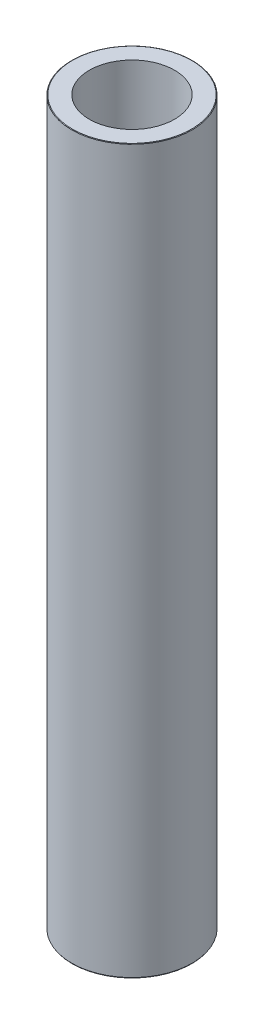
ISO-10303-21;
HEADER;
FILE_DESCRIPTION(('STEP AP214'),'2;1');
FILE_NAME('part.step','',(''),(''),'','','');
FILE_SCHEMA(('AUTOMOTIVE_DESIGN { 1 0 10303 214 1 1 1 1 }'));
ENDSEC;
DATA;
#1=APPLICATION_CONTEXT('core data for automotive mechanical design processes');
#2=APPLICATION_PROTOCOL_DEFINITION('international standard','automotive_design',2000,#1);
#3=PRODUCT_CONTEXT('',#1,'mechanical');
#4=PRODUCT('Part','Part','',(#3));
#5=PRODUCT_RELATED_PRODUCT_CATEGORY('part','',(#4));
#6=PRODUCT_DEFINITION_FORMATION('','',#4);
#7=PRODUCT_DEFINITION_CONTEXT('part definition',#1,'design');
#8=PRODUCT_DEFINITION('design','',#6,#7);
#9=PRODUCT_DEFINITION_SHAPE('','',#8);
#10=(LENGTH_UNIT() NAMED_UNIT(*) SI_UNIT(.MILLI.,.METRE.));
#11=(NAMED_UNIT(*) PLANE_ANGLE_UNIT() SI_UNIT($,.RADIAN.));
#12=(NAMED_UNIT(*) SI_UNIT($,.STERADIAN.) SOLID_ANGLE_UNIT());
#13=UNCERTAINTY_MEASURE_WITH_UNIT(LENGTH_MEASURE(1.E-05),#10,'distance_accuracy_value','');
#14=(GEOMETRIC_REPRESENTATION_CONTEXT(3) GLOBAL_UNCERTAINTY_ASSIGNED_CONTEXT((#13)) GLOBAL_UNIT_ASSIGNED_CONTEXT((#10,
#11,#12)) REPRESENTATION_CONTEXT('',''));
#15=CARTESIAN_POINT('',(0.,0.,0.));
#16=DIRECTION('',(0.,0.,1.));
#17=DIRECTION('',(1.,0.,0.));
#18=AXIS2_PLACEMENT_3D('',#15,#16,#17);
#19=CARTESIAN_POINT('',(0.,600.,0.));
#20=DIRECTION('',(0.,-1.,0.));
#21=DIRECTION('',(0.,0.,-1.));
#22=AXIS2_PLACEMENT_3D('',#19,#20,#21);
#23=CYLINDRICAL_SURFACE('',#22,50.);
#24=CARTESIAN_POINT('',(0.,599.69116420001,0.));
#25=DIRECTION('',(0.,1.,0.));
#26=DIRECTION('',(0.,0.,1.));
#27=AXIS2_PLACEMENT_3D('',#24,#25,#26);
#28=CIRCLE('',#27,50.);
#29=CARTESIAN_POINT('',(0.,599.69116420001,50.));
#30=VERTEX_POINT('',#29);
#31=EDGE_CURVE('E50',#30,#30,#28,.F.);
#32=ORIENTED_EDGE('',*,*,#31,.T.);
#33=EDGE_LOOP('',(#32));
#34=FACE_BOUND('',#33,.T.);
#35=CARTESIAN_POINT('',(0.,0.534919296779512,0.));
#36=DIRECTION('',(0.,1.,0.));
#37=DIRECTION('',(0.,0.,1.));
#38=AXIS2_PLACEMENT_3D('',#35,#36,#37);
#39=CIRCLE('',#38,50.);
#40=CARTESIAN_POINT('',(0.,0.534919296779512,50.));
#41=VERTEX_POINT('',#40);
#42=EDGE_CURVE('E51',#41,#41,#39,.T.);
#43=ORIENTED_EDGE('',*,*,#42,.T.);
#44=EDGE_LOOP('',(#43));
#45=FACE_BOUND('',#44,.T.);
#46=ADVANCED_FACE('F39',(#34,#45),#23,.T.);
#47=CARTESIAN_POINT('',(0.,600.,0.));
#48=DIRECTION('',(0.,1.,0.));
#49=DIRECTION('',(0.,0.,1.));
#50=AXIS2_PLACEMENT_3D('',#47,#48,#49);
#51=PLANE('',#50);
#52=CARTESIAN_POINT('',(0.,600.,0.));
#53=DIRECTION('',(0.,1.,0.));
#54=DIRECTION('',(0.,0.,1.));
#55=AXIS2_PLACEMENT_3D('',#52,#53,#54);
#56=CIRCLE('',#55,49.4650807032204);
#57=CARTESIAN_POINT('',(0.,600.,49.4650807032204));
#58=VERTEX_POINT('',#57);
#59=EDGE_CURVE('E54',#58,#58,#56,.T.);
#60=ORIENTED_EDGE('',*,*,#59,.T.);
#61=EDGE_LOOP('',(#60));
#62=FACE_BOUND('',#61,.T.);
#63=CARTESIAN_POINT('',(0.,600.,0.));
#64=DIRECTION('',(0.,1.,0.));
#65=DIRECTION('',(0.,0.,1.));
#66=AXIS2_PLACEMENT_3D('',#63,#64,#65);
#67=CIRCLE('',#66,35.3533003629534);
#68=CARTESIAN_POINT('',(0.,600.,35.3533003629534));
#69=VERTEX_POINT('',#68);
#70=EDGE_CURVE('E58',#69,#69,#67,.T.);
#71=ORIENTED_EDGE('',*,*,#70,.F.);
#72=EDGE_LOOP('',(#71));
#73=FACE_BOUND('',#72,.T.);
#74=ADVANCED_FACE('F69',(#62,#73),#51,.T.);
#75=CARTESIAN_POINT('',(0.,0.,0.));
#76=DIRECTION('',(0.,1.,0.));
#77=DIRECTION('',(0.,0.,1.));
#78=AXIS2_PLACEMENT_3D('',#75,#76,#77);
#79=PLANE('',#78);
#80=CARTESIAN_POINT('',(0.,0.,0.));
#81=DIRECTION('',(0.,1.,0.));
#82=DIRECTION('',(0.,0.,1.));
#83=AXIS2_PLACEMENT_3D('',#80,#81,#82);
#84=CIRCLE('',#83,49.6911642000096);
#85=CARTESIAN_POINT('',(0.,0.,49.6911642000096));
#86=VERTEX_POINT('',#85);
#87=EDGE_CURVE('E10',#86,#86,#84,.F.);
#88=ORIENTED_EDGE('',*,*,#87,.T.);
#89=EDGE_LOOP('',(#88));
#90=FACE_BOUND('',#89,.T.);
#91=CARTESIAN_POINT('',(0.,0.,0.));
#92=DIRECTION('',(0.,1.,0.));
#93=DIRECTION('',(0.,0.,1.));
#94=AXIS2_PLACEMENT_3D('',#91,#92,#93);
#95=CIRCLE('',#94,35.3533003629534);
#96=CARTESIAN_POINT('',(0.,0.,35.3533003629534));
#97=VERTEX_POINT('',#96);
#98=EDGE_CURVE('E63',#97,#97,#95,.T.);
#99=ORIENTED_EDGE('',*,*,#98,.T.);
#100=EDGE_LOOP('',(#99));
#101=FACE_BOUND('',#100,.T.);
#102=ADVANCED_FACE('F75',(#90,#101),#79,.F.);
#103=CARTESIAN_POINT('',(0.,600.,0.));
#104=DIRECTION('',(0.,-1.,0.));
#105=DIRECTION('',(0.,0.,-1.));
#106=AXIS2_PLACEMENT_3D('',#103,#104,#105);
#107=CYLINDRICAL_SURFACE('',#106,35.3533003629534);
#108=ORIENTED_EDGE('',*,*,#70,.T.);
#109=EDGE_LOOP('',(#108));
#110=FACE_BOUND('',#109,.T.);
#111=ORIENTED_EDGE('',*,*,#98,.F.);
#112=EDGE_LOOP('',(#111));
#113=FACE_BOUND('',#112,.T.);
#114=ADVANCED_FACE('F70',(#110,#113),#107,.F.);
#115=CARTESIAN_POINT('',(0.,600.,0.));
#116=DIRECTION('',(0.,-1.,0.));
#117=DIRECTION('',(0.,0.,-1.));
#118=AXIS2_PLACEMENT_3D('',#115,#116,#117);
#119=CONICAL_SURFACE('',#118,49.4650807032204,1.0471975511966);
#120=ORIENTED_EDGE('',*,*,#31,.F.);
#121=EDGE_LOOP('',(#120));
#122=FACE_BOUND('',#121,.T.);
#123=ORIENTED_EDGE('',*,*,#59,.F.);
#124=EDGE_LOOP('',(#123));
#125=FACE_BOUND('',#124,.T.);
#126=ADVANCED_FACE('F81',(#122,#125),#119,.T.);
#127=CARTESIAN_POINT('',(0.,0.534919296779512,0.));
#128=DIRECTION('',(0.,1.,0.));
#129=DIRECTION('',(0.,0.,1.));
#130=AXIS2_PLACEMENT_3D('',#127,#128,#129);
#131=CONICAL_SURFACE('',#130,50.,0.523598775598293);
#132=ORIENTED_EDGE('',*,*,#87,.F.);
#133=EDGE_LOOP('',(#132));
#134=FACE_BOUND('',#133,.T.);
#135=ORIENTED_EDGE('',*,*,#42,.F.);
#136=EDGE_LOOP('',(#135));
#137=FACE_BOUND('',#136,.T.);
#138=ADVANCED_FACE('F45',(#134,#137),#131,.T.);
#139=CLOSED_SHELL('',(#46,#74,#102,#114,#126,#138));
#140=MANIFOLD_SOLID_BREP('B2',#139);
#141=ADVANCED_BREP_SHAPE_REPRESENTATION('',(#18,#140),#14);
#142=SHAPE_DEFINITION_REPRESENTATION(#9,#141);
ENDSEC;
END-ISO-10303-21;
